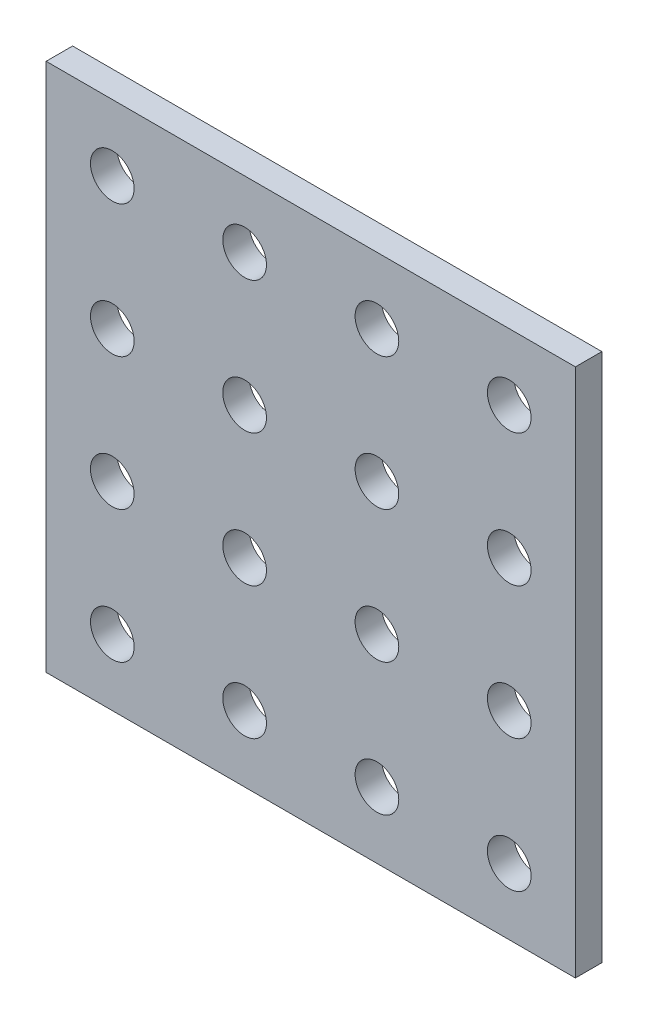
ISO-10303-21;
HEADER;
FILE_DESCRIPTION(('STEP AP214'),'2;1');
FILE_NAME('part.step','',(''),(''),'','','');
FILE_SCHEMA(('AUTOMOTIVE_DESIGN { 1 0 10303 214 1 1 1 1 }'));
ENDSEC;
DATA;
#1=APPLICATION_CONTEXT('core data for automotive mechanical design processes');
#2=APPLICATION_PROTOCOL_DEFINITION('international standard','automotive_design',2000,#1);
#3=PRODUCT_CONTEXT('',#1,'mechanical');
#4=PRODUCT('Part','Part','',(#3));
#5=PRODUCT_RELATED_PRODUCT_CATEGORY('part','',(#4));
#6=PRODUCT_DEFINITION_FORMATION('','',#4);
#7=PRODUCT_DEFINITION_CONTEXT('part definition',#1,'design');
#8=PRODUCT_DEFINITION('design','',#6,#7);
#9=PRODUCT_DEFINITION_SHAPE('','',#8);
#10=(LENGTH_UNIT() NAMED_UNIT(*) SI_UNIT(.MILLI.,.METRE.));
#11=(NAMED_UNIT(*) PLANE_ANGLE_UNIT() SI_UNIT($,.RADIAN.));
#12=(NAMED_UNIT(*) SI_UNIT($,.STERADIAN.) SOLID_ANGLE_UNIT());
#13=UNCERTAINTY_MEASURE_WITH_UNIT(LENGTH_MEASURE(1.E-05),#10,'distance_accuracy_value','');
#14=(GEOMETRIC_REPRESENTATION_CONTEXT(3) GLOBAL_UNCERTAINTY_ASSIGNED_CONTEXT((#13)) GLOBAL_UNIT_ASSIGNED_CONTEXT((#10,
#11,#12)) REPRESENTATION_CONTEXT('',''));
#15=CARTESIAN_POINT('',(0.,0.,0.));
#16=DIRECTION('',(0.,0.,1.));
#17=DIRECTION('',(1.,0.,0.));
#18=AXIS2_PLACEMENT_3D('',#15,#16,#17);
#19=CARTESIAN_POINT('',(15.,-15.,0.));
#20=DIRECTION('',(0.,0.,1.));
#21=DIRECTION('',(1.,0.,0.));
#22=AXIS2_PLACEMENT_3D('',#19,#20,#21);
#23=CYLINDRICAL_SURFACE('',#22,1.65);
#24=CARTESIAN_POINT('',(15.,-15.,0.));
#25=DIRECTION('',(0.,0.,1.));
#26=DIRECTION('',(1.,0.,0.));
#27=AXIS2_PLACEMENT_3D('',#24,#25,#26);
#28=CIRCLE('',#27,1.65);
#29=CARTESIAN_POINT('',(16.65,-15.,0.));
#30=VERTEX_POINT('',#29);
#31=EDGE_CURVE('E41',#30,#30,#28,.T.);
#32=ORIENTED_EDGE('',*,*,#31,.F.);
#33=EDGE_LOOP('',(#32));
#34=FACE_BOUND('',#33,.T.);
#35=CARTESIAN_POINT('',(15.,-15.,2.));
#36=DIRECTION('',(0.,0.,1.));
#37=DIRECTION('',(1.,0.,0.));
#38=AXIS2_PLACEMENT_3D('',#35,#36,#37);
#39=CIRCLE('',#38,1.65);
#40=CARTESIAN_POINT('',(16.65,-15.,2.));
#41=VERTEX_POINT('',#40);
#42=EDGE_CURVE('E11',#41,#41,#39,.T.);
#43=ORIENTED_EDGE('',*,*,#42,.T.);
#44=EDGE_LOOP('',(#43));
#45=FACE_BOUND('',#44,.T.);
#46=ADVANCED_FACE('F33',(#34,#45),#23,.F.);
#47=CARTESIAN_POINT('',(15.,-5.,0.));
#48=DIRECTION('',(0.,0.,1.));
#49=DIRECTION('',(1.,0.,0.));
#50=AXIS2_PLACEMENT_3D('',#47,#48,#49);
#51=CYLINDRICAL_SURFACE('',#50,1.65);
#52=CARTESIAN_POINT('',(15.,-5.,0.));
#53=DIRECTION('',(0.,0.,1.));
#54=DIRECTION('',(1.,0.,0.));
#55=AXIS2_PLACEMENT_3D('',#52,#53,#54);
#56=CIRCLE('',#55,1.65);
#57=CARTESIAN_POINT('',(16.65,-5.,0.));
#58=VERTEX_POINT('',#57);
#59=EDGE_CURVE('E183',#58,#58,#56,.T.);
#60=ORIENTED_EDGE('',*,*,#59,.F.);
#61=EDGE_LOOP('',(#60));
#62=FACE_BOUND('',#61,.T.);
#63=CARTESIAN_POINT('',(15.,-5.,2.));
#64=DIRECTION('',(0.,0.,1.));
#65=DIRECTION('',(1.,0.,0.));
#66=AXIS2_PLACEMENT_3D('',#63,#64,#65);
#67=CIRCLE('',#66,1.65);
#68=CARTESIAN_POINT('',(16.65,-5.,2.));
#69=VERTEX_POINT('',#68);
#70=EDGE_CURVE('E186',#69,#69,#67,.T.);
#71=ORIENTED_EDGE('',*,*,#70,.T.);
#72=EDGE_LOOP('',(#71));
#73=FACE_BOUND('',#72,.T.);
#74=ADVANCED_FACE('F195',(#62,#73),#51,.F.);
#75=CARTESIAN_POINT('',(15.,5.,0.));
#76=DIRECTION('',(0.,0.,1.));
#77=DIRECTION('',(1.,0.,0.));
#78=AXIS2_PLACEMENT_3D('',#75,#76,#77);
#79=CYLINDRICAL_SURFACE('',#78,1.65);
#80=CARTESIAN_POINT('',(15.,5.,0.));
#81=DIRECTION('',(0.,0.,1.));
#82=DIRECTION('',(1.,0.,0.));
#83=AXIS2_PLACEMENT_3D('',#80,#81,#82);
#84=CIRCLE('',#83,1.65);
#85=CARTESIAN_POINT('',(16.65,5.,0.));
#86=VERTEX_POINT('',#85);
#87=EDGE_CURVE('E177',#86,#86,#84,.T.);
#88=ORIENTED_EDGE('',*,*,#87,.F.);
#89=EDGE_LOOP('',(#88));
#90=FACE_BOUND('',#89,.T.);
#91=CARTESIAN_POINT('',(15.,5.,2.));
#92=DIRECTION('',(0.,0.,1.));
#93=DIRECTION('',(1.,0.,0.));
#94=AXIS2_PLACEMENT_3D('',#91,#92,#93);
#95=CIRCLE('',#94,1.65);
#96=CARTESIAN_POINT('',(16.65,5.,2.));
#97=VERTEX_POINT('',#96);
#98=EDGE_CURVE('E180',#97,#97,#95,.T.);
#99=ORIENTED_EDGE('',*,*,#98,.T.);
#100=EDGE_LOOP('',(#99));
#101=FACE_BOUND('',#100,.T.);
#102=ADVANCED_FACE('F266',(#90,#101),#79,.F.);
#103=CARTESIAN_POINT('',(15.,15.,0.));
#104=DIRECTION('',(0.,0.,1.));
#105=DIRECTION('',(1.,0.,0.));
#106=AXIS2_PLACEMENT_3D('',#103,#104,#105);
#107=CYLINDRICAL_SURFACE('',#106,1.65);
#108=CARTESIAN_POINT('',(15.,15.,0.));
#109=DIRECTION('',(0.,0.,1.));
#110=DIRECTION('',(1.,0.,0.));
#111=AXIS2_PLACEMENT_3D('',#108,#109,#110);
#112=CIRCLE('',#111,1.65);
#113=CARTESIAN_POINT('',(16.65,15.,0.));
#114=VERTEX_POINT('',#113);
#115=EDGE_CURVE('E171',#114,#114,#112,.T.);
#116=ORIENTED_EDGE('',*,*,#115,.F.);
#117=EDGE_LOOP('',(#116));
#118=FACE_BOUND('',#117,.T.);
#119=CARTESIAN_POINT('',(15.,15.,2.));
#120=DIRECTION('',(0.,0.,1.));
#121=DIRECTION('',(1.,0.,0.));
#122=AXIS2_PLACEMENT_3D('',#119,#120,#121);
#123=CIRCLE('',#122,1.65);
#124=CARTESIAN_POINT('',(16.65,15.,2.));
#125=VERTEX_POINT('',#124);
#126=EDGE_CURVE('E174',#125,#125,#123,.T.);
#127=ORIENTED_EDGE('',*,*,#126,.T.);
#128=EDGE_LOOP('',(#127));
#129=FACE_BOUND('',#128,.T.);
#130=ADVANCED_FACE('F262',(#118,#129),#107,.F.);
#131=CARTESIAN_POINT('',(5.,-15.,0.));
#132=DIRECTION('',(0.,0.,1.));
#133=DIRECTION('',(1.,0.,0.));
#134=AXIS2_PLACEMENT_3D('',#131,#132,#133);
#135=CYLINDRICAL_SURFACE('',#134,1.65);
#136=CARTESIAN_POINT('',(5.,-15.,0.));
#137=DIRECTION('',(0.,0.,1.));
#138=DIRECTION('',(1.,0.,0.));
#139=AXIS2_PLACEMENT_3D('',#136,#137,#138);
#140=CIRCLE('',#139,1.65);
#141=CARTESIAN_POINT('',(6.65,-15.,0.));
#142=VERTEX_POINT('',#141);
#143=EDGE_CURVE('E165',#142,#142,#140,.T.);
#144=ORIENTED_EDGE('',*,*,#143,.F.);
#145=EDGE_LOOP('',(#144));
#146=FACE_BOUND('',#145,.T.);
#147=CARTESIAN_POINT('',(5.,-15.,2.));
#148=DIRECTION('',(0.,0.,1.));
#149=DIRECTION('',(1.,0.,0.));
#150=AXIS2_PLACEMENT_3D('',#147,#148,#149);
#151=CIRCLE('',#150,1.65);
#152=CARTESIAN_POINT('',(6.65,-15.,2.));
#153=VERTEX_POINT('',#152);
#154=EDGE_CURVE('E168',#153,#153,#151,.T.);
#155=ORIENTED_EDGE('',*,*,#154,.T.);
#156=EDGE_LOOP('',(#155));
#157=FACE_BOUND('',#156,.T.);
#158=ADVANCED_FACE('F258',(#146,#157),#135,.F.);
#159=CARTESIAN_POINT('',(5.,-5.,0.));
#160=DIRECTION('',(0.,0.,1.));
#161=DIRECTION('',(1.,0.,0.));
#162=AXIS2_PLACEMENT_3D('',#159,#160,#161);
#163=CYLINDRICAL_SURFACE('',#162,1.65);
#164=CARTESIAN_POINT('',(5.,-5.,0.));
#165=DIRECTION('',(0.,0.,1.));
#166=DIRECTION('',(1.,0.,0.));
#167=AXIS2_PLACEMENT_3D('',#164,#165,#166);
#168=CIRCLE('',#167,1.65);
#169=CARTESIAN_POINT('',(6.65,-5.,0.));
#170=VERTEX_POINT('',#169);
#171=EDGE_CURVE('E159',#170,#170,#168,.T.);
#172=ORIENTED_EDGE('',*,*,#171,.F.);
#173=EDGE_LOOP('',(#172));
#174=FACE_BOUND('',#173,.T.);
#175=CARTESIAN_POINT('',(5.,-5.,2.));
#176=DIRECTION('',(0.,0.,1.));
#177=DIRECTION('',(1.,0.,0.));
#178=AXIS2_PLACEMENT_3D('',#175,#176,#177);
#179=CIRCLE('',#178,1.65);
#180=CARTESIAN_POINT('',(6.65,-5.,2.));
#181=VERTEX_POINT('',#180);
#182=EDGE_CURVE('E162',#181,#181,#179,.T.);
#183=ORIENTED_EDGE('',*,*,#182,.T.);
#184=EDGE_LOOP('',(#183));
#185=FACE_BOUND('',#184,.T.);
#186=ADVANCED_FACE('F254',(#174,#185),#163,.F.);
#187=CARTESIAN_POINT('',(5.,5.,0.));
#188=DIRECTION('',(0.,0.,1.));
#189=DIRECTION('',(1.,0.,0.));
#190=AXIS2_PLACEMENT_3D('',#187,#188,#189);
#191=CYLINDRICAL_SURFACE('',#190,1.65);
#192=CARTESIAN_POINT('',(5.,5.,0.));
#193=DIRECTION('',(0.,0.,1.));
#194=DIRECTION('',(1.,0.,0.));
#195=AXIS2_PLACEMENT_3D('',#192,#193,#194);
#196=CIRCLE('',#195,1.65);
#197=CARTESIAN_POINT('',(6.65,5.,0.));
#198=VERTEX_POINT('',#197);
#199=EDGE_CURVE('E153',#198,#198,#196,.T.);
#200=ORIENTED_EDGE('',*,*,#199,.F.);
#201=EDGE_LOOP('',(#200));
#202=FACE_BOUND('',#201,.T.);
#203=CARTESIAN_POINT('',(5.,5.,2.));
#204=DIRECTION('',(0.,0.,1.));
#205=DIRECTION('',(1.,0.,0.));
#206=AXIS2_PLACEMENT_3D('',#203,#204,#205);
#207=CIRCLE('',#206,1.65);
#208=CARTESIAN_POINT('',(6.65,5.,2.));
#209=VERTEX_POINT('',#208);
#210=EDGE_CURVE('E156',#209,#209,#207,.T.);
#211=ORIENTED_EDGE('',*,*,#210,.T.);
#212=EDGE_LOOP('',(#211));
#213=FACE_BOUND('',#212,.T.);
#214=ADVANCED_FACE('F250',(#202,#213),#191,.F.);
#215=CARTESIAN_POINT('',(5.,15.,0.));
#216=DIRECTION('',(0.,0.,1.));
#217=DIRECTION('',(1.,0.,0.));
#218=AXIS2_PLACEMENT_3D('',#215,#216,#217);
#219=CYLINDRICAL_SURFACE('',#218,1.65);
#220=CARTESIAN_POINT('',(5.,15.,0.));
#221=DIRECTION('',(0.,0.,1.));
#222=DIRECTION('',(1.,0.,0.));
#223=AXIS2_PLACEMENT_3D('',#220,#221,#222);
#224=CIRCLE('',#223,1.65);
#225=CARTESIAN_POINT('',(6.65,15.,0.));
#226=VERTEX_POINT('',#225);
#227=EDGE_CURVE('E147',#226,#226,#224,.T.);
#228=ORIENTED_EDGE('',*,*,#227,.F.);
#229=EDGE_LOOP('',(#228));
#230=FACE_BOUND('',#229,.T.);
#231=CARTESIAN_POINT('',(5.,15.,2.));
#232=DIRECTION('',(0.,0.,1.));
#233=DIRECTION('',(1.,0.,0.));
#234=AXIS2_PLACEMENT_3D('',#231,#232,#233);
#235=CIRCLE('',#234,1.65);
#236=CARTESIAN_POINT('',(6.65,15.,2.));
#237=VERTEX_POINT('',#236);
#238=EDGE_CURVE('E150',#237,#237,#235,.T.);
#239=ORIENTED_EDGE('',*,*,#238,.T.);
#240=EDGE_LOOP('',(#239));
#241=FACE_BOUND('',#240,.T.);
#242=ADVANCED_FACE('F246',(#230,#241),#219,.F.);
#243=CARTESIAN_POINT('',(-5.,-15.,0.));
#244=DIRECTION('',(0.,0.,1.));
#245=DIRECTION('',(1.,0.,0.));
#246=AXIS2_PLACEMENT_3D('',#243,#244,#245);
#247=CYLINDRICAL_SURFACE('',#246,1.65);
#248=CARTESIAN_POINT('',(-5.,-15.,0.));
#249=DIRECTION('',(0.,0.,1.));
#250=DIRECTION('',(1.,0.,0.));
#251=AXIS2_PLACEMENT_3D('',#248,#249,#250);
#252=CIRCLE('',#251,1.65);
#253=CARTESIAN_POINT('',(-3.35,-15.,0.));
#254=VERTEX_POINT('',#253);
#255=EDGE_CURVE('E141',#254,#254,#252,.T.);
#256=ORIENTED_EDGE('',*,*,#255,.F.);
#257=EDGE_LOOP('',(#256));
#258=FACE_BOUND('',#257,.T.);
#259=CARTESIAN_POINT('',(-5.,-15.,2.));
#260=DIRECTION('',(0.,0.,1.));
#261=DIRECTION('',(1.,0.,0.));
#262=AXIS2_PLACEMENT_3D('',#259,#260,#261);
#263=CIRCLE('',#262,1.65);
#264=CARTESIAN_POINT('',(-3.35,-15.,2.));
#265=VERTEX_POINT('',#264);
#266=EDGE_CURVE('E144',#265,#265,#263,.T.);
#267=ORIENTED_EDGE('',*,*,#266,.T.);
#268=EDGE_LOOP('',(#267));
#269=FACE_BOUND('',#268,.T.);
#270=ADVANCED_FACE('F242',(#258,#269),#247,.F.);
#271=CARTESIAN_POINT('',(-5.,-5.,0.));
#272=DIRECTION('',(0.,0.,1.));
#273=DIRECTION('',(1.,0.,0.));
#274=AXIS2_PLACEMENT_3D('',#271,#272,#273);
#275=CYLINDRICAL_SURFACE('',#274,1.65);
#276=CARTESIAN_POINT('',(-5.,-5.,0.));
#277=DIRECTION('',(0.,0.,1.));
#278=DIRECTION('',(1.,0.,0.));
#279=AXIS2_PLACEMENT_3D('',#276,#277,#278);
#280=CIRCLE('',#279,1.65);
#281=CARTESIAN_POINT('',(-3.35,-5.,0.));
#282=VERTEX_POINT('',#281);
#283=EDGE_CURVE('E135',#282,#282,#280,.T.);
#284=ORIENTED_EDGE('',*,*,#283,.F.);
#285=EDGE_LOOP('',(#284));
#286=FACE_BOUND('',#285,.T.);
#287=CARTESIAN_POINT('',(-5.,-5.,2.));
#288=DIRECTION('',(0.,0.,1.));
#289=DIRECTION('',(1.,0.,0.));
#290=AXIS2_PLACEMENT_3D('',#287,#288,#289);
#291=CIRCLE('',#290,1.65);
#292=CARTESIAN_POINT('',(-3.35,-5.,2.));
#293=VERTEX_POINT('',#292);
#294=EDGE_CURVE('E138',#293,#293,#291,.T.);
#295=ORIENTED_EDGE('',*,*,#294,.T.);
#296=EDGE_LOOP('',(#295));
#297=FACE_BOUND('',#296,.T.);
#298=ADVANCED_FACE('F238',(#286,#297),#275,.F.);
#299=CARTESIAN_POINT('',(-5.,5.,0.));
#300=DIRECTION('',(0.,0.,1.));
#301=DIRECTION('',(1.,0.,0.));
#302=AXIS2_PLACEMENT_3D('',#299,#300,#301);
#303=CYLINDRICAL_SURFACE('',#302,1.65);
#304=CARTESIAN_POINT('',(-5.,5.,0.));
#305=DIRECTION('',(0.,0.,1.));
#306=DIRECTION('',(1.,0.,0.));
#307=AXIS2_PLACEMENT_3D('',#304,#305,#306);
#308=CIRCLE('',#307,1.65);
#309=CARTESIAN_POINT('',(-3.35,5.,0.));
#310=VERTEX_POINT('',#309);
#311=EDGE_CURVE('E129',#310,#310,#308,.T.);
#312=ORIENTED_EDGE('',*,*,#311,.F.);
#313=EDGE_LOOP('',(#312));
#314=FACE_BOUND('',#313,.T.);
#315=CARTESIAN_POINT('',(-5.,5.,2.));
#316=DIRECTION('',(0.,0.,1.));
#317=DIRECTION('',(1.,0.,0.));
#318=AXIS2_PLACEMENT_3D('',#315,#316,#317);
#319=CIRCLE('',#318,1.65);
#320=CARTESIAN_POINT('',(-3.35,5.,2.));
#321=VERTEX_POINT('',#320);
#322=EDGE_CURVE('E132',#321,#321,#319,.T.);
#323=ORIENTED_EDGE('',*,*,#322,.T.);
#324=EDGE_LOOP('',(#323));
#325=FACE_BOUND('',#324,.T.);
#326=ADVANCED_FACE('F234',(#314,#325),#303,.F.);
#327=CARTESIAN_POINT('',(-5.,15.,0.));
#328=DIRECTION('',(0.,0.,1.));
#329=DIRECTION('',(1.,0.,0.));
#330=AXIS2_PLACEMENT_3D('',#327,#328,#329);
#331=CYLINDRICAL_SURFACE('',#330,1.65);
#332=CARTESIAN_POINT('',(-5.,15.,0.));
#333=DIRECTION('',(0.,0.,1.));
#334=DIRECTION('',(1.,0.,0.));
#335=AXIS2_PLACEMENT_3D('',#332,#333,#334);
#336=CIRCLE('',#335,1.65);
#337=CARTESIAN_POINT('',(-3.35,15.,0.));
#338=VERTEX_POINT('',#337);
#339=EDGE_CURVE('E123',#338,#338,#336,.T.);
#340=ORIENTED_EDGE('',*,*,#339,.F.);
#341=EDGE_LOOP('',(#340));
#342=FACE_BOUND('',#341,.T.);
#343=CARTESIAN_POINT('',(-5.,15.,2.));
#344=DIRECTION('',(0.,0.,1.));
#345=DIRECTION('',(1.,0.,0.));
#346=AXIS2_PLACEMENT_3D('',#343,#344,#345);
#347=CIRCLE('',#346,1.65);
#348=CARTESIAN_POINT('',(-3.35,15.,2.));
#349=VERTEX_POINT('',#348);
#350=EDGE_CURVE('E126',#349,#349,#347,.T.);
#351=ORIENTED_EDGE('',*,*,#350,.T.);
#352=EDGE_LOOP('',(#351));
#353=FACE_BOUND('',#352,.T.);
#354=ADVANCED_FACE('F230',(#342,#353),#331,.F.);
#355=CARTESIAN_POINT('',(-15.,-15.,0.));
#356=DIRECTION('',(0.,0.,1.));
#357=DIRECTION('',(1.,0.,0.));
#358=AXIS2_PLACEMENT_3D('',#355,#356,#357);
#359=CYLINDRICAL_SURFACE('',#358,1.65);
#360=CARTESIAN_POINT('',(-15.,-15.,0.));
#361=DIRECTION('',(0.,0.,1.));
#362=DIRECTION('',(1.,0.,0.));
#363=AXIS2_PLACEMENT_3D('',#360,#361,#362);
#364=CIRCLE('',#363,1.65);
#365=CARTESIAN_POINT('',(-13.35,-15.,0.));
#366=VERTEX_POINT('',#365);
#367=EDGE_CURVE('E117',#366,#366,#364,.T.);
#368=ORIENTED_EDGE('',*,*,#367,.F.);
#369=EDGE_LOOP('',(#368));
#370=FACE_BOUND('',#369,.T.);
#371=CARTESIAN_POINT('',(-15.,-15.,2.));
#372=DIRECTION('',(0.,0.,1.));
#373=DIRECTION('',(1.,0.,0.));
#374=AXIS2_PLACEMENT_3D('',#371,#372,#373);
#375=CIRCLE('',#374,1.65);
#376=CARTESIAN_POINT('',(-13.35,-15.,2.));
#377=VERTEX_POINT('',#376);
#378=EDGE_CURVE('E120',#377,#377,#375,.T.);
#379=ORIENTED_EDGE('',*,*,#378,.T.);
#380=EDGE_LOOP('',(#379));
#381=FACE_BOUND('',#380,.T.);
#382=ADVANCED_FACE('F226',(#370,#381),#359,.F.);
#383=CARTESIAN_POINT('',(-15.,-5.,0.));
#384=DIRECTION('',(0.,0.,1.));
#385=DIRECTION('',(1.,0.,0.));
#386=AXIS2_PLACEMENT_3D('',#383,#384,#385);
#387=CYLINDRICAL_SURFACE('',#386,1.65);
#388=CARTESIAN_POINT('',(-15.,-5.,0.));
#389=DIRECTION('',(0.,0.,1.));
#390=DIRECTION('',(1.,0.,0.));
#391=AXIS2_PLACEMENT_3D('',#388,#389,#390);
#392=CIRCLE('',#391,1.65);
#393=CARTESIAN_POINT('',(-13.35,-5.,0.));
#394=VERTEX_POINT('',#393);
#395=EDGE_CURVE('E111',#394,#394,#392,.T.);
#396=ORIENTED_EDGE('',*,*,#395,.F.);
#397=EDGE_LOOP('',(#396));
#398=FACE_BOUND('',#397,.T.);
#399=CARTESIAN_POINT('',(-15.,-5.,2.));
#400=DIRECTION('',(0.,0.,1.));
#401=DIRECTION('',(1.,0.,0.));
#402=AXIS2_PLACEMENT_3D('',#399,#400,#401);
#403=CIRCLE('',#402,1.65);
#404=CARTESIAN_POINT('',(-13.35,-5.,2.));
#405=VERTEX_POINT('',#404);
#406=EDGE_CURVE('E114',#405,#405,#403,.T.);
#407=ORIENTED_EDGE('',*,*,#406,.T.);
#408=EDGE_LOOP('',(#407));
#409=FACE_BOUND('',#408,.T.);
#410=ADVANCED_FACE('F222',(#398,#409),#387,.F.);
#411=CARTESIAN_POINT('',(20.,-20.,2.));
#412=DIRECTION('',(-1.,0.,0.));
#413=DIRECTION('',(0.,0.,1.));
#414=AXIS2_PLACEMENT_3D('',#411,#412,#413);
#415=PLANE('',#414);
#416=DIRECTION('',(0.,1.,0.));
#417=VECTOR('',#416,1.);
#418=CARTESIAN_POINT('',(20.,-20.,0.));
#419=LINE('',#418,#417);
#420=CARTESIAN_POINT('',(20.,-20.,0.));
#421=VERTEX_POINT('',#420);
#422=CARTESIAN_POINT('',(20.,20.,0.));
#423=VERTEX_POINT('',#422);
#424=EDGE_CURVE('E101',#421,#423,#419,.T.);
#425=ORIENTED_EDGE('',*,*,#424,.T.);
#426=DIRECTION('',(0.,0.,-1.));
#427=VECTOR('',#426,1.);
#428=CARTESIAN_POINT('',(20.,20.,2.));
#429=LINE('',#428,#427);
#430=CARTESIAN_POINT('',(20.,20.,2.));
#431=VERTEX_POINT('',#430);
#432=EDGE_CURVE('E92',#431,#423,#429,.T.);
#433=ORIENTED_EDGE('',*,*,#432,.F.);
#434=DIRECTION('',(0.,1.,0.));
#435=VECTOR('',#434,1.);
#436=CARTESIAN_POINT('',(20.,-20.,2.));
#437=LINE('',#436,#435);
#438=CARTESIAN_POINT('',(20.,-20.,2.));
#439=VERTEX_POINT('',#438);
#440=EDGE_CURVE('E86',#439,#431,#437,.T.);
#441=ORIENTED_EDGE('',*,*,#440,.F.);
#442=DIRECTION('',(0.,0.,-1.));
#443=VECTOR('',#442,1.);
#444=CARTESIAN_POINT('',(20.,-20.,2.));
#445=LINE('',#444,#443);
#446=EDGE_CURVE('E97',#439,#421,#445,.T.);
#447=ORIENTED_EDGE('',*,*,#446,.T.);
#448=EDGE_LOOP('',(#425,#433,#441,#447));
#449=FACE_BOUND('',#448,.T.);
#450=ADVANCED_FACE('F219',(#449),#415,.F.);
#451=CARTESIAN_POINT('',(-20.,20.,2.));
#452=DIRECTION('',(0.,-1.,0.));
#453=DIRECTION('',(0.,0.,-1.));
#454=AXIS2_PLACEMENT_3D('',#451,#452,#453);
#455=PLANE('',#454);
#456=DIRECTION('',(-1.,0.,0.));
#457=VECTOR('',#456,1.);
#458=CARTESIAN_POINT('',(-20.,20.,0.));
#459=LINE('',#458,#457);
#460=CARTESIAN_POINT('',(-20.,20.,0.));
#461=VERTEX_POINT('',#460);
#462=EDGE_CURVE('E91',#423,#461,#459,.T.);
#463=ORIENTED_EDGE('',*,*,#462,.T.);
#464=DIRECTION('',(0.,0.,-1.));
#465=VECTOR('',#464,1.);
#466=CARTESIAN_POINT('',(-20.,20.,2.));
#467=LINE('',#466,#465);
#468=CARTESIAN_POINT('',(-20.,20.,2.));
#469=VERTEX_POINT('',#468);
#470=EDGE_CURVE('E89',#469,#461,#467,.T.);
#471=ORIENTED_EDGE('',*,*,#470,.F.);
#472=DIRECTION('',(-1.,0.,0.));
#473=VECTOR('',#472,1.);
#474=CARTESIAN_POINT('',(-20.,20.,2.));
#475=LINE('',#474,#473);
#476=EDGE_CURVE('E80',#431,#469,#475,.T.);
#477=ORIENTED_EDGE('',*,*,#476,.F.);
#478=ORIENTED_EDGE('',*,*,#432,.T.);
#479=EDGE_LOOP('',(#463,#471,#477,#478));
#480=FACE_BOUND('',#479,.T.);
#481=ADVANCED_FACE('F90',(#480),#455,.F.);
#482=CARTESIAN_POINT('',(-20.,-20.,2.));
#483=DIRECTION('',(1.,0.,0.));
#484=DIRECTION('',(0.,0.,-1.));
#485=AXIS2_PLACEMENT_3D('',#482,#483,#484);
#486=PLANE('',#485);
#487=DIRECTION('',(0.,-1.,0.));
#488=VECTOR('',#487,1.);
#489=CARTESIAN_POINT('',(-20.,-20.,0.));
#490=LINE('',#489,#488);
#491=CARTESIAN_POINT('',(-20.,-20.,0.));
#492=VERTEX_POINT('',#491);
#493=EDGE_CURVE('E66',#461,#492,#490,.T.);
#494=ORIENTED_EDGE('',*,*,#493,.T.);
#495=DIRECTION('',(0.,0.,-1.));
#496=VECTOR('',#495,1.);
#497=CARTESIAN_POINT('',(-20.,-20.,2.));
#498=LINE('',#497,#496);
#499=CARTESIAN_POINT('',(-20.,-20.,2.));
#500=VERTEX_POINT('',#499);
#501=EDGE_CURVE('E93',#500,#492,#498,.T.);
#502=ORIENTED_EDGE('',*,*,#501,.F.);
#503=DIRECTION('',(0.,-1.,0.));
#504=VECTOR('',#503,1.);
#505=CARTESIAN_POINT('',(-20.,-20.,2.));
#506=LINE('',#505,#504);
#507=EDGE_CURVE('E84',#469,#500,#506,.T.);
#508=ORIENTED_EDGE('',*,*,#507,.F.);
#509=ORIENTED_EDGE('',*,*,#470,.T.);
#510=EDGE_LOOP('',(#494,#502,#508,#509));
#511=FACE_BOUND('',#510,.T.);
#512=ADVANCED_FACE('F95',(#511),#486,.F.);
#513=CARTESIAN_POINT('',(-20.,-20.,2.));
#514=DIRECTION('',(0.,1.,0.));
#515=DIRECTION('',(0.,0.,1.));
#516=AXIS2_PLACEMENT_3D('',#513,#514,#515);
#517=PLANE('',#516);
#518=DIRECTION('',(1.,0.,0.));
#519=VECTOR('',#518,1.);
#520=CARTESIAN_POINT('',(-20.,-20.,0.));
#521=LINE('',#520,#519);
#522=EDGE_CURVE('E72',#492,#421,#521,.T.);
#523=ORIENTED_EDGE('',*,*,#522,.T.);
#524=ORIENTED_EDGE('',*,*,#446,.F.);
#525=DIRECTION('',(1.,0.,0.));
#526=VECTOR('',#525,1.);
#527=CARTESIAN_POINT('',(-20.,-20.,2.));
#528=LINE('',#527,#526);
#529=EDGE_CURVE('E49',#500,#439,#528,.T.);
#530=ORIENTED_EDGE('',*,*,#529,.F.);
#531=ORIENTED_EDGE('',*,*,#501,.T.);
#532=EDGE_LOOP('',(#523,#524,#530,#531));
#533=FACE_BOUND('',#532,.T.);
#534=ADVANCED_FACE('F199',(#533),#517,.F.);
#535=CARTESIAN_POINT('',(0.,0.,2.));
#536=DIRECTION('',(0.,0.,-1.));
#537=DIRECTION('',(-1.,0.,0.));
#538=AXIS2_PLACEMENT_3D('',#535,#536,#537);
#539=PLANE('',#538);
#540=CARTESIAN_POINT('',(-15.,5.,2.));
#541=DIRECTION('',(0.,0.,1.));
#542=DIRECTION('',(1.,0.,0.));
#543=AXIS2_PLACEMENT_3D('',#540,#541,#542);
#544=CIRCLE('',#543,1.65);
#545=CARTESIAN_POINT('',(-13.35,5.,2.));
#546=VERTEX_POINT('',#545);
#547=EDGE_CURVE('E411',#546,#546,#544,.T.);
#548=ORIENTED_EDGE('',*,*,#547,.F.);
#549=EDGE_LOOP('',(#548));
#550=FACE_BOUND('',#549,.T.);
#551=CARTESIAN_POINT('',(-15.,15.,2.));
#552=DIRECTION('',(0.,0.,1.));
#553=DIRECTION('',(1.,0.,0.));
#554=AXIS2_PLACEMENT_3D('',#551,#552,#553);
#555=CIRCLE('',#554,1.65);
#556=CARTESIAN_POINT('',(-13.35,15.,2.));
#557=VERTEX_POINT('',#556);
#558=EDGE_CURVE('E412',#557,#557,#555,.T.);
#559=ORIENTED_EDGE('',*,*,#558,.F.);
#560=EDGE_LOOP('',(#559));
#561=FACE_BOUND('',#560,.T.);
#562=ORIENTED_EDGE('',*,*,#440,.T.);
#563=ORIENTED_EDGE('',*,*,#476,.T.);
#564=ORIENTED_EDGE('',*,*,#507,.T.);
#565=ORIENTED_EDGE('',*,*,#529,.T.);
#566=EDGE_LOOP('',(#562,#563,#564,#565));
#567=FACE_BOUND('',#566,.T.);
#568=ORIENTED_EDGE('',*,*,#406,.F.);
#569=EDGE_LOOP('',(#568));
#570=FACE_BOUND('',#569,.T.);
#571=ORIENTED_EDGE('',*,*,#378,.F.);
#572=EDGE_LOOP('',(#571));
#573=FACE_BOUND('',#572,.T.);
#574=ORIENTED_EDGE('',*,*,#350,.F.);
#575=EDGE_LOOP('',(#574));
#576=FACE_BOUND('',#575,.T.);
#577=ORIENTED_EDGE('',*,*,#322,.F.);
#578=EDGE_LOOP('',(#577));
#579=FACE_BOUND('',#578,.T.);
#580=ORIENTED_EDGE('',*,*,#294,.F.);
#581=EDGE_LOOP('',(#580));
#582=FACE_BOUND('',#581,.T.);
#583=ORIENTED_EDGE('',*,*,#266,.F.);
#584=EDGE_LOOP('',(#583));
#585=FACE_BOUND('',#584,.T.);
#586=ORIENTED_EDGE('',*,*,#238,.F.);
#587=EDGE_LOOP('',(#586));
#588=FACE_BOUND('',#587,.T.);
#589=ORIENTED_EDGE('',*,*,#210,.F.);
#590=EDGE_LOOP('',(#589));
#591=FACE_BOUND('',#590,.T.);
#592=ORIENTED_EDGE('',*,*,#182,.F.);
#593=EDGE_LOOP('',(#592));
#594=FACE_BOUND('',#593,.T.);
#595=ORIENTED_EDGE('',*,*,#154,.F.);
#596=EDGE_LOOP('',(#595));
#597=FACE_BOUND('',#596,.T.);
#598=ORIENTED_EDGE('',*,*,#126,.F.);
#599=EDGE_LOOP('',(#598));
#600=FACE_BOUND('',#599,.T.);
#601=ORIENTED_EDGE('',*,*,#98,.F.);
#602=EDGE_LOOP('',(#601));
#603=FACE_BOUND('',#602,.T.);
#604=ORIENTED_EDGE('',*,*,#70,.F.);
#605=EDGE_LOOP('',(#604));
#606=FACE_BOUND('',#605,.T.);
#607=ORIENTED_EDGE('',*,*,#42,.F.);
#608=EDGE_LOOP('',(#607));
#609=FACE_BOUND('',#608,.T.);
#610=ADVANCED_FACE('F81',(#550,#561,#567,#570,#573,#576,#579,#582,#585,#588,#591,#594,#597,#600,
#603,#606,#609),#539,.F.);
#611=CARTESIAN_POINT('',(0.,0.,0.));
#612=DIRECTION('',(0.,0.,-1.));
#613=DIRECTION('',(-1.,0.,0.));
#614=AXIS2_PLACEMENT_3D('',#611,#612,#613);
#615=PLANE('',#614);
#616=CARTESIAN_POINT('',(-15.,5.,0.));
#617=DIRECTION('',(0.,0.,1.));
#618=DIRECTION('',(1.,0.,0.));
#619=AXIS2_PLACEMENT_3D('',#616,#617,#618);
#620=CIRCLE('',#619,1.65);
#621=CARTESIAN_POINT('',(-13.35,5.,0.));
#622=VERTEX_POINT('',#621);
#623=EDGE_CURVE('E409',#622,#622,#620,.T.);
#624=ORIENTED_EDGE('',*,*,#623,.T.);
#625=EDGE_LOOP('',(#624));
#626=FACE_BOUND('',#625,.T.);
#627=CARTESIAN_POINT('',(-15.,15.,0.));
#628=DIRECTION('',(0.,0.,1.));
#629=DIRECTION('',(1.,0.,0.));
#630=AXIS2_PLACEMENT_3D('',#627,#628,#629);
#631=CIRCLE('',#630,1.65);
#632=CARTESIAN_POINT('',(-13.35,15.,0.));
#633=VERTEX_POINT('',#632);
#634=EDGE_CURVE('E104',#633,#633,#631,.T.);
#635=ORIENTED_EDGE('',*,*,#634,.T.);
#636=EDGE_LOOP('',(#635));
#637=FACE_BOUND('',#636,.T.);
#638=ORIENTED_EDGE('',*,*,#424,.F.);
#639=ORIENTED_EDGE('',*,*,#522,.F.);
#640=ORIENTED_EDGE('',*,*,#493,.F.);
#641=ORIENTED_EDGE('',*,*,#462,.F.);
#642=EDGE_LOOP('',(#638,#639,#640,#641));
#643=FACE_BOUND('',#642,.T.);
#644=ORIENTED_EDGE('',*,*,#395,.T.);
#645=EDGE_LOOP('',(#644));
#646=FACE_BOUND('',#645,.T.);
#647=ORIENTED_EDGE('',*,*,#367,.T.);
#648=EDGE_LOOP('',(#647));
#649=FACE_BOUND('',#648,.T.);
#650=ORIENTED_EDGE('',*,*,#339,.T.);
#651=EDGE_LOOP('',(#650));
#652=FACE_BOUND('',#651,.T.);
#653=ORIENTED_EDGE('',*,*,#311,.T.);
#654=EDGE_LOOP('',(#653));
#655=FACE_BOUND('',#654,.T.);
#656=ORIENTED_EDGE('',*,*,#283,.T.);
#657=EDGE_LOOP('',(#656));
#658=FACE_BOUND('',#657,.T.);
#659=ORIENTED_EDGE('',*,*,#255,.T.);
#660=EDGE_LOOP('',(#659));
#661=FACE_BOUND('',#660,.T.);
#662=ORIENTED_EDGE('',*,*,#227,.T.);
#663=EDGE_LOOP('',(#662));
#664=FACE_BOUND('',#663,.T.);
#665=ORIENTED_EDGE('',*,*,#199,.T.);
#666=EDGE_LOOP('',(#665));
#667=FACE_BOUND('',#666,.T.);
#668=ORIENTED_EDGE('',*,*,#171,.T.);
#669=EDGE_LOOP('',(#668));
#670=FACE_BOUND('',#669,.T.);
#671=ORIENTED_EDGE('',*,*,#143,.T.);
#672=EDGE_LOOP('',(#671));
#673=FACE_BOUND('',#672,.T.);
#674=ORIENTED_EDGE('',*,*,#115,.T.);
#675=EDGE_LOOP('',(#674));
#676=FACE_BOUND('',#675,.T.);
#677=ORIENTED_EDGE('',*,*,#87,.T.);
#678=EDGE_LOOP('',(#677));
#679=FACE_BOUND('',#678,.T.);
#680=ORIENTED_EDGE('',*,*,#59,.T.);
#681=EDGE_LOOP('',(#680));
#682=FACE_BOUND('',#681,.T.);
#683=ORIENTED_EDGE('',*,*,#31,.T.);
#684=EDGE_LOOP('',(#683));
#685=FACE_BOUND('',#684,.T.);
#686=ADVANCED_FACE('F191',(#626,#637,#643,#646,#649,#652,#655,#658,#661,#664,#667,#670,#673,
#676,#679,#682,#685),#615,.T.);
#687=CARTESIAN_POINT('',(-15.,15.,0.));
#688=DIRECTION('',(0.,0.,1.));
#689=DIRECTION('',(1.,0.,0.));
#690=AXIS2_PLACEMENT_3D('',#687,#688,#689);
#691=CYLINDRICAL_SURFACE('',#690,1.65);
#692=ORIENTED_EDGE('',*,*,#634,.F.);
#693=EDGE_LOOP('',(#692));
#694=FACE_BOUND('',#693,.T.);
#695=ORIENTED_EDGE('',*,*,#558,.T.);
#696=EDGE_LOOP('',(#695));
#697=FACE_BOUND('',#696,.T.);
#698=ADVANCED_FACE('F206',(#694,#697),#691,.F.);
#699=CARTESIAN_POINT('',(-15.,5.,0.));
#700=DIRECTION('',(0.,0.,1.));
#701=DIRECTION('',(1.,0.,0.));
#702=AXIS2_PLACEMENT_3D('',#699,#700,#701);
#703=CYLINDRICAL_SURFACE('',#702,1.65);
#704=ORIENTED_EDGE('',*,*,#623,.F.);
#705=EDGE_LOOP('',(#704));
#706=FACE_BOUND('',#705,.T.);
#707=ORIENTED_EDGE('',*,*,#547,.T.);
#708=EDGE_LOOP('',(#707));
#709=FACE_BOUND('',#708,.T.);
#710=ADVANCED_FACE('F354',(#706,#709),#703,.F.);
#711=CLOSED_SHELL('',(#46,#74,#102,#130,#158,#186,#214,#242,#270,#298,#326,#354,#382,#410,#450,
#481,#512,#534,#610,#686,#698,#710));
#712=MANIFOLD_SOLID_BREP('B2',#711);
#713=ADVANCED_BREP_SHAPE_REPRESENTATION('',(#18,#712),#14);
#714=SHAPE_DEFINITION_REPRESENTATION(#9,#713);
ENDSEC;
END-ISO-10303-21;
